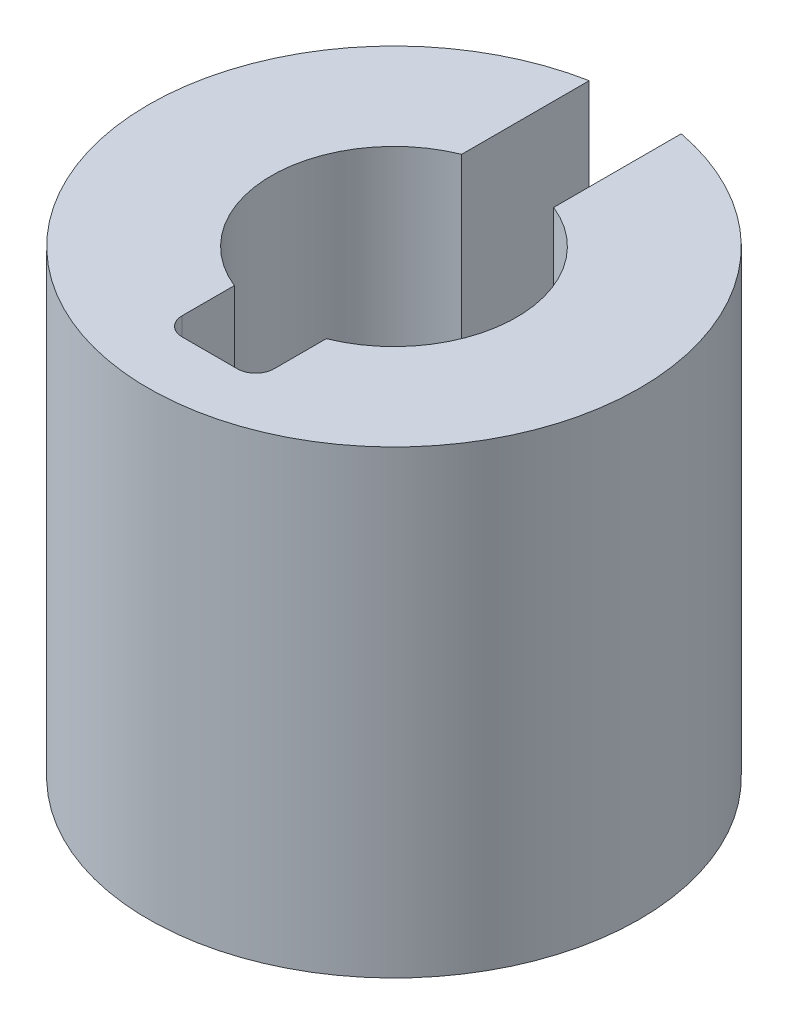
ISO-10303-21;
HEADER;
FILE_DESCRIPTION(('STEP AP214'),'2;1');
FILE_NAME('part.step','',(''),(''),'','','');
FILE_SCHEMA(('AUTOMOTIVE_DESIGN { 1 0 10303 214 1 1 1 1 }'));
ENDSEC;
DATA;
#1=APPLICATION_CONTEXT('core data for automotive mechanical design processes');
#2=APPLICATION_PROTOCOL_DEFINITION('international standard','automotive_design',2000,#1);
#3=PRODUCT_CONTEXT('',#1,'mechanical');
#4=PRODUCT('Part','Part','',(#3));
#5=PRODUCT_RELATED_PRODUCT_CATEGORY('part','',(#4));
#6=PRODUCT_DEFINITION_FORMATION('','',#4);
#7=PRODUCT_DEFINITION_CONTEXT('part definition',#1,'design');
#8=PRODUCT_DEFINITION('design','',#6,#7);
#9=PRODUCT_DEFINITION_SHAPE('','',#8);
#10=(LENGTH_UNIT() NAMED_UNIT(*) SI_UNIT(.MILLI.,.METRE.));
#11=(NAMED_UNIT(*) PLANE_ANGLE_UNIT() SI_UNIT($,.RADIAN.));
#12=(NAMED_UNIT(*) SI_UNIT($,.STERADIAN.) SOLID_ANGLE_UNIT());
#13=UNCERTAINTY_MEASURE_WITH_UNIT(LENGTH_MEASURE(1.E-05),#10,'distance_accuracy_value','');
#14=(GEOMETRIC_REPRESENTATION_CONTEXT(3) GLOBAL_UNCERTAINTY_ASSIGNED_CONTEXT((#13)) GLOBAL_UNIT_ASSIGNED_CONTEXT((#10,
#11,#12)) REPRESENTATION_CONTEXT('',''));
#15=CARTESIAN_POINT('',(0.,0.,0.));
#16=DIRECTION('',(0.,0.,1.));
#17=DIRECTION('',(1.,0.,0.));
#18=AXIS2_PLACEMENT_3D('',#15,#16,#17);
#19=CARTESIAN_POINT('',(-0.75,3.75,3.005));
#20=DIRECTION('',(0.,0.,1.));
#21=DIRECTION('',(1.,0.,0.));
#22=AXIS2_PLACEMENT_3D('',#19,#20,#21);
#23=PLANE('',#22);
#24=DIRECTION('',(0.,1.,0.));
#25=VECTOR('',#24,1.);
#26=CARTESIAN_POINT('',(-0.45,3.75,3.005));
#27=LINE('',#26,#25);
#28=CARTESIAN_POINT('',(-0.45,-3.75,3.005));
#29=VERTEX_POINT('',#28);
#30=CARTESIAN_POINT('',(-0.45,3.75,3.005));
#31=VERTEX_POINT('',#30);
#32=EDGE_CURVE('E114',#29,#31,#27,.T.);
#33=ORIENTED_EDGE('',*,*,#32,.T.);
#34=DIRECTION('',(1.,0.,0.));
#35=VECTOR('',#34,1.);
#36=CARTESIAN_POINT('',(-0.75,3.75,3.005));
#37=LINE('',#36,#35);
#38=CARTESIAN_POINT('',(0.45,3.75,3.005));
#39=VERTEX_POINT('',#38);
#40=EDGE_CURVE('E102',#39,#31,#37,.F.);
#41=ORIENTED_EDGE('',*,*,#40,.F.);
#42=DIRECTION('',(0.,1.,0.));
#43=VECTOR('',#42,1.);
#44=CARTESIAN_POINT('',(0.45,3.75,3.005));
#45=LINE('',#44,#43);
#46=CARTESIAN_POINT('',(0.45,-3.75,3.005));
#47=VERTEX_POINT('',#46);
#48=EDGE_CURVE('E101',#39,#47,#45,.F.);
#49=ORIENTED_EDGE('',*,*,#48,.T.);
#50=DIRECTION('',(1.,0.,0.));
#51=VECTOR('',#50,1.);
#52=CARTESIAN_POINT('',(-0.75,-3.75,3.005));
#53=LINE('',#52,#51);
#54=EDGE_CURVE('E91',#29,#47,#53,.T.);
#55=ORIENTED_EDGE('',*,*,#54,.F.);
#56=EDGE_LOOP('',(#33,#41,#49,#55));
#57=FACE_BOUND('',#56,.T.);
#58=ADVANCED_FACE('F16',(#57),#23,.F.);
#59=CARTESIAN_POINT('',(0.45,3.75,2.705));
#60=DIRECTION('',(0.,1.,0.));
#61=DIRECTION('',(0.,0.,1.));
#62=AXIS2_PLACEMENT_3D('',#59,#60,#61);
#63=CYLINDRICAL_SURFACE('',#62,0.3);
#64=DIRECTION('',(0.,1.,0.));
#65=VECTOR('',#64,1.);
#66=CARTESIAN_POINT('',(0.75,3.75,2.705));
#67=LINE('',#66,#65);
#68=CARTESIAN_POINT('',(0.75,3.75,2.705));
#69=VERTEX_POINT('',#68);
#70=CARTESIAN_POINT('',(0.75,-3.75,2.705));
#71=VERTEX_POINT('',#70);
#72=EDGE_CURVE('E111',#69,#71,#67,.F.);
#73=ORIENTED_EDGE('',*,*,#72,.T.);
#74=CARTESIAN_POINT('',(0.45,-3.75,2.705));
#75=DIRECTION('',(0.,1.,0.));
#76=DIRECTION('',(0.,0.,1.));
#77=AXIS2_PLACEMENT_3D('',#74,#75,#76);
#78=CIRCLE('',#77,0.3);
#79=EDGE_CURVE('E19',#47,#71,#78,.T.);
#80=ORIENTED_EDGE('',*,*,#79,.F.);
#81=ORIENTED_EDGE('',*,*,#48,.F.);
#82=CARTESIAN_POINT('',(0.45,3.75,2.705));
#83=DIRECTION('',(0.,1.,0.));
#84=DIRECTION('',(0.,0.,1.));
#85=AXIS2_PLACEMENT_3D('',#82,#83,#84);
#86=CIRCLE('',#85,0.3);
#87=EDGE_CURVE('E113',#69,#39,#86,.F.);
#88=ORIENTED_EDGE('',*,*,#87,.F.);
#89=EDGE_LOOP('',(#73,#80,#81,#88));
#90=FACE_BOUND('',#89,.T.);
#91=ADVANCED_FACE('F109',(#90),#63,.F.);
#92=CARTESIAN_POINT('',(-0.45,3.75,2.705));
#93=DIRECTION('',(0.,1.,0.));
#94=DIRECTION('',(0.,0.,1.));
#95=AXIS2_PLACEMENT_3D('',#92,#93,#94);
#96=CYLINDRICAL_SURFACE('',#95,0.3);
#97=ORIENTED_EDGE('',*,*,#32,.F.);
#98=CARTESIAN_POINT('',(-0.45,-3.75,2.705));
#99=DIRECTION('',(0.,1.,0.));
#100=DIRECTION('',(0.,0.,1.));
#101=AXIS2_PLACEMENT_3D('',#98,#99,#100);
#102=CIRCLE('',#101,0.3);
#103=CARTESIAN_POINT('',(-0.75,-3.75,2.705));
#104=VERTEX_POINT('',#103);
#105=EDGE_CURVE('E97',#104,#29,#102,.T.);
#106=ORIENTED_EDGE('',*,*,#105,.F.);
#107=DIRECTION('',(0.,1.,0.));
#108=VECTOR('',#107,1.);
#109=CARTESIAN_POINT('',(-0.75,3.75,2.705));
#110=LINE('',#109,#108);
#111=CARTESIAN_POINT('',(-0.75,3.75,2.705));
#112=VERTEX_POINT('',#111);
#113=EDGE_CURVE('E145',#104,#112,#110,.T.);
#114=ORIENTED_EDGE('',*,*,#113,.T.);
#115=CARTESIAN_POINT('',(-0.45,3.75,2.705));
#116=DIRECTION('',(0.,1.,0.));
#117=DIRECTION('',(0.,0.,1.));
#118=AXIS2_PLACEMENT_3D('',#115,#116,#117);
#119=CIRCLE('',#118,0.3);
#120=EDGE_CURVE('E117',#31,#112,#119,.F.);
#121=ORIENTED_EDGE('',*,*,#120,.F.);
#122=EDGE_LOOP('',(#97,#106,#114,#121));
#123=FACE_BOUND('',#122,.T.);
#124=ADVANCED_FACE('F183',(#123),#96,.F.);
#125=CARTESIAN_POINT('',(0.75,3.75,3.005));
#126=DIRECTION('',(1.,0.,0.));
#127=DIRECTION('',(0.,0.,-1.));
#128=AXIS2_PLACEMENT_3D('',#125,#126,#127);
#129=PLANE('',#128);
#130=ORIENTED_EDGE('',*,*,#72,.F.);
#131=DIRECTION('',(0.,0.,-1.));
#132=VECTOR('',#131,1.);
#133=CARTESIAN_POINT('',(0.75,3.75,3.005));
#134=LINE('',#133,#132);
#135=CARTESIAN_POINT('',(0.75,3.75,1.85404962177392));
#136=VERTEX_POINT('',#135);
#137=EDGE_CURVE('E119',#136,#69,#134,.F.);
#138=ORIENTED_EDGE('',*,*,#137,.F.);
#139=DIRECTION('',(0.,-1.,0.));
#140=VECTOR('',#139,1.);
#141=CARTESIAN_POINT('',(0.75,3.75,1.85404962177392));
#142=LINE('',#141,#140);
#143=CARTESIAN_POINT('',(0.75,-3.75,1.85404962177392));
#144=VERTEX_POINT('',#143);
#145=EDGE_CURVE('E153',#136,#144,#142,.T.);
#146=ORIENTED_EDGE('',*,*,#145,.T.);
#147=DIRECTION('',(0.,0.,-1.));
#148=VECTOR('',#147,1.);
#149=CARTESIAN_POINT('',(0.75,-3.75,3.005));
#150=LINE('',#149,#148);
#151=EDGE_CURVE('E144',#71,#144,#150,.T.);
#152=ORIENTED_EDGE('',*,*,#151,.F.);
#153=EDGE_LOOP('',(#130,#138,#146,#152));
#154=FACE_BOUND('',#153,.T.);
#155=ADVANCED_FACE('F180',(#154),#129,.F.);
#156=CARTESIAN_POINT('',(-0.75,3.75,3.005));
#157=DIRECTION('',(-1.,0.,0.));
#158=DIRECTION('',(0.,0.,1.));
#159=AXIS2_PLACEMENT_3D('',#156,#157,#158);
#160=PLANE('',#159);
#161=ORIENTED_EDGE('',*,*,#113,.F.);
#162=DIRECTION('',(0.,0.,1.));
#163=VECTOR('',#162,1.);
#164=CARTESIAN_POINT('',(-0.75,-3.75,3.005));
#165=LINE('',#164,#163);
#166=CARTESIAN_POINT('',(-0.75,-3.75,1.85404962177392));
#167=VERTEX_POINT('',#166);
#168=EDGE_CURVE('E149',#167,#104,#165,.T.);
#169=ORIENTED_EDGE('',*,*,#168,.F.);
#170=DIRECTION('',(0.,-1.,0.));
#171=VECTOR('',#170,1.);
#172=CARTESIAN_POINT('',(-0.749999999999999,3.75,1.85404962177392));
#173=LINE('',#172,#171);
#174=CARTESIAN_POINT('',(-0.75,3.75,1.85404962177392));
#175=VERTEX_POINT('',#174);
#176=EDGE_CURVE('E123',#167,#175,#173,.F.);
#177=ORIENTED_EDGE('',*,*,#176,.T.);
#178=DIRECTION('',(0.,0.,1.));
#179=VECTOR('',#178,1.);
#180=CARTESIAN_POINT('',(-0.75,3.75,3.005));
#181=LINE('',#180,#179);
#182=EDGE_CURVE('E148',#112,#175,#181,.F.);
#183=ORIENTED_EDGE('',*,*,#182,.F.);
#184=EDGE_LOOP('',(#161,#169,#177,#183));
#185=FACE_BOUND('',#184,.T.);
#186=ADVANCED_FACE('F182',(#185),#160,.F.);
#187=CARTESIAN_POINT('',(0.,3.75,0.));
#188=DIRECTION('',(0.,-1.,0.));
#189=DIRECTION('',(0.,0.,-1.));
#190=AXIS2_PLACEMENT_3D('',#187,#188,#189);
#191=CYLINDRICAL_SURFACE('',#190,2.);
#192=ORIENTED_EDGE('',*,*,#145,.F.);
#193=CARTESIAN_POINT('',(0.,3.75,0.));
#194=DIRECTION('',(0.,-1.,0.));
#195=DIRECTION('',(0.,0.,-1.));
#196=AXIS2_PLACEMENT_3D('',#193,#194,#195);
#197=CIRCLE('',#196,2.);
#198=CARTESIAN_POINT('',(0.75,3.75,-1.85404962177392));
#199=VERTEX_POINT('',#198);
#200=EDGE_CURVE('E127',#199,#136,#197,.T.);
#201=ORIENTED_EDGE('',*,*,#200,.F.);
#202=DIRECTION('',(0.,1.,0.));
#203=VECTOR('',#202,1.);
#204=CARTESIAN_POINT('',(0.75,3.75,-1.85404962177392));
#205=LINE('',#204,#203);
#206=CARTESIAN_POINT('',(0.75,-3.75,-1.85404962177392));
#207=VERTEX_POINT('',#206);
#208=EDGE_CURVE('E126',#199,#207,#205,.F.);
#209=ORIENTED_EDGE('',*,*,#208,.T.);
#210=CARTESIAN_POINT('',(0.,-3.75,0.));
#211=DIRECTION('',(0.,-1.,0.));
#212=DIRECTION('',(0.,0.,-1.));
#213=AXIS2_PLACEMENT_3D('',#210,#211,#212);
#214=CIRCLE('',#213,2.);
#215=EDGE_CURVE('E122',#207,#144,#214,.T.);
#216=ORIENTED_EDGE('',*,*,#215,.T.);
#217=EDGE_LOOP('',(#192,#201,#209,#216));
#218=FACE_BOUND('',#217,.T.);
#219=ADVANCED_FACE('F178',(#218),#191,.F.);
#220=CARTESIAN_POINT('',(0.,3.75,0.));
#221=DIRECTION('',(0.,-1.,0.));
#222=DIRECTION('',(0.,0.,-1.));
#223=AXIS2_PLACEMENT_3D('',#220,#221,#222);
#224=CYLINDRICAL_SURFACE('',#223,2.);
#225=DIRECTION('',(0.,1.,0.));
#226=VECTOR('',#225,1.);
#227=CARTESIAN_POINT('',(-0.75,3.75,-1.85404962177392));
#228=LINE('',#227,#226);
#229=CARTESIAN_POINT('',(-0.75,-3.75,-1.85404962177392));
#230=VERTEX_POINT('',#229);
#231=CARTESIAN_POINT('',(-0.75,3.75,-1.85404962177392));
#232=VERTEX_POINT('',#231);
#233=EDGE_CURVE('E160',#230,#232,#228,.T.);
#234=ORIENTED_EDGE('',*,*,#233,.T.);
#235=CARTESIAN_POINT('',(0.,3.75,0.));
#236=DIRECTION('',(0.,-1.,0.));
#237=DIRECTION('',(0.,0.,-1.));
#238=AXIS2_PLACEMENT_3D('',#235,#236,#237);
#239=CIRCLE('',#238,2.);
#240=EDGE_CURVE('E130',#175,#232,#239,.T.);
#241=ORIENTED_EDGE('',*,*,#240,.F.);
#242=ORIENTED_EDGE('',*,*,#176,.F.);
#243=CARTESIAN_POINT('',(0.,-3.75,0.));
#244=DIRECTION('',(0.,-1.,0.));
#245=DIRECTION('',(0.,0.,-1.));
#246=AXIS2_PLACEMENT_3D('',#243,#244,#245);
#247=CIRCLE('',#246,2.);
#248=EDGE_CURVE('E120',#167,#230,#247,.T.);
#249=ORIENTED_EDGE('',*,*,#248,.T.);
#250=EDGE_LOOP('',(#234,#241,#242,#249));
#251=FACE_BOUND('',#250,.T.);
#252=ADVANCED_FACE('F211',(#251),#224,.F.);
#253=CARTESIAN_POINT('',(0.,-3.75,0.));
#254=DIRECTION('',(0.,1.,0.));
#255=DIRECTION('',(0.,0.,1.));
#256=AXIS2_PLACEMENT_3D('',#253,#254,#255);
#257=PLANE('',#256);
#258=DIRECTION('',(0.,0.,-1.));
#259=VECTOR('',#258,1.);
#260=CARTESIAN_POINT('',(0.75,-3.75,-1.85404962177392));
#261=LINE('',#260,#259);
#262=CARTESIAN_POINT('',(0.75,-3.75,-3.9341485737069));
#263=VERTEX_POINT('',#262);
#264=EDGE_CURVE('E131',#207,#263,#261,.T.);
#265=ORIENTED_EDGE('',*,*,#264,.T.);
#266=CARTESIAN_POINT('',(0.,-3.75,0.));
#267=DIRECTION('',(0.,-1.,0.));
#268=DIRECTION('',(0.,0.,-1.));
#269=AXIS2_PLACEMENT_3D('',#266,#267,#268);
#270=CIRCLE('',#269,4.005);
#271=CARTESIAN_POINT('',(-0.75,-3.75,-3.9341485737069));
#272=VERTEX_POINT('',#271);
#273=EDGE_CURVE('E134',#272,#263,#270,.F.);
#274=ORIENTED_EDGE('',*,*,#273,.F.);
#275=DIRECTION('',(0.,0.,1.));
#276=VECTOR('',#275,1.);
#277=CARTESIAN_POINT('',(-0.75,-3.75,-1.85404962177392));
#278=LINE('',#277,#276);
#279=EDGE_CURVE('E138',#272,#230,#278,.T.);
#280=ORIENTED_EDGE('',*,*,#279,.T.);
#281=ORIENTED_EDGE('',*,*,#248,.F.);
#282=ORIENTED_EDGE('',*,*,#168,.T.);
#283=ORIENTED_EDGE('',*,*,#105,.T.);
#284=ORIENTED_EDGE('',*,*,#54,.T.);
#285=ORIENTED_EDGE('',*,*,#79,.T.);
#286=ORIENTED_EDGE('',*,*,#151,.T.);
#287=ORIENTED_EDGE('',*,*,#215,.F.);
#288=EDGE_LOOP('',(#265,#274,#280,#281,#282,#283,#284,#285,#286,#287));
#289=FACE_BOUND('',#288,.T.);
#290=ADVANCED_FACE('F93',(#289),#257,.F.);
#291=CARTESIAN_POINT('',(0.75,3.75,-1.85404962177392));
#292=DIRECTION('',(1.,0.,0.));
#293=DIRECTION('',(0.,0.,-1.));
#294=AXIS2_PLACEMENT_3D('',#291,#292,#293);
#295=PLANE('',#294);
#296=ORIENTED_EDGE('',*,*,#208,.F.);
#297=DIRECTION('',(0.,0.,1.));
#298=VECTOR('',#297,1.);
#299=CARTESIAN_POINT('',(0.75,3.75,0.));
#300=LINE('',#299,#298);
#301=CARTESIAN_POINT('',(0.75,3.75,-3.9341485737069));
#302=VERTEX_POINT('',#301);
#303=EDGE_CURVE('E133',#302,#199,#300,.T.);
#304=ORIENTED_EDGE('',*,*,#303,.F.);
#305=DIRECTION('',(0.,-1.,0.));
#306=VECTOR('',#305,1.);
#307=CARTESIAN_POINT('',(0.75,3.75,-3.9341485737069));
#308=LINE('',#307,#306);
#309=EDGE_CURVE('E137',#263,#302,#308,.F.);
#310=ORIENTED_EDGE('',*,*,#309,.F.);
#311=ORIENTED_EDGE('',*,*,#264,.F.);
#312=EDGE_LOOP('',(#296,#304,#310,#311));
#313=FACE_BOUND('',#312,.T.);
#314=ADVANCED_FACE('F173',(#313),#295,.F.);
#315=CARTESIAN_POINT('',(0.,3.75,0.));
#316=DIRECTION('',(0.,1.,0.));
#317=DIRECTION('',(0.,0.,1.));
#318=AXIS2_PLACEMENT_3D('',#315,#316,#317);
#319=PLANE('',#318);
#320=CARTESIAN_POINT('',(0.,3.75,0.));
#321=DIRECTION('',(0.,-1.,0.));
#322=DIRECTION('',(0.,0.,-1.));
#323=AXIS2_PLACEMENT_3D('',#320,#321,#322);
#324=CIRCLE('',#323,4.005);
#325=CARTESIAN_POINT('',(-0.75,3.75,-3.9341485737069));
#326=VERTEX_POINT('',#325);
#327=EDGE_CURVE('E25',#302,#326,#324,.T.);
#328=ORIENTED_EDGE('',*,*,#327,.F.);
#329=ORIENTED_EDGE('',*,*,#303,.T.);
#330=ORIENTED_EDGE('',*,*,#200,.T.);
#331=ORIENTED_EDGE('',*,*,#137,.T.);
#332=ORIENTED_EDGE('',*,*,#87,.T.);
#333=ORIENTED_EDGE('',*,*,#40,.T.);
#334=ORIENTED_EDGE('',*,*,#120,.T.);
#335=ORIENTED_EDGE('',*,*,#182,.T.);
#336=ORIENTED_EDGE('',*,*,#240,.T.);
#337=DIRECTION('',(0.,0.,1.));
#338=VECTOR('',#337,1.);
#339=CARTESIAN_POINT('',(-0.75,3.75,-1.85404962177392));
#340=LINE('',#339,#338);
#341=EDGE_CURVE('E34',#232,#326,#340,.F.);
#342=ORIENTED_EDGE('',*,*,#341,.T.);
#343=EDGE_LOOP('',(#328,#329,#330,#331,#332,#333,#334,#335,#336,#342));
#344=FACE_BOUND('',#343,.T.);
#345=ADVANCED_FACE('F169',(#344),#319,.T.);
#346=CARTESIAN_POINT('',(-0.75,3.75,-1.85404962177392));
#347=DIRECTION('',(-1.,0.,0.));
#348=DIRECTION('',(0.,0.,1.));
#349=AXIS2_PLACEMENT_3D('',#346,#347,#348);
#350=PLANE('',#349);
#351=DIRECTION('',(0.,-1.,0.));
#352=VECTOR('',#351,1.);
#353=CARTESIAN_POINT('',(-0.75,3.75,-3.9341485737069));
#354=LINE('',#353,#352);
#355=EDGE_CURVE('E11',#326,#272,#354,.T.);
#356=ORIENTED_EDGE('',*,*,#355,.F.);
#357=ORIENTED_EDGE('',*,*,#341,.F.);
#358=ORIENTED_EDGE('',*,*,#233,.F.);
#359=ORIENTED_EDGE('',*,*,#279,.F.);
#360=EDGE_LOOP('',(#356,#357,#358,#359));
#361=FACE_BOUND('',#360,.T.);
#362=ADVANCED_FACE('F196',(#361),#350,.F.);
#363=CARTESIAN_POINT('',(0.,3.75,0.));
#364=DIRECTION('',(0.,-1.,0.));
#365=DIRECTION('',(0.,0.,-1.));
#366=AXIS2_PLACEMENT_3D('',#363,#364,#365);
#367=CYLINDRICAL_SURFACE('',#366,4.005);
#368=ORIENTED_EDGE('',*,*,#327,.T.);
#369=ORIENTED_EDGE('',*,*,#355,.T.);
#370=ORIENTED_EDGE('',*,*,#273,.T.);
#371=ORIENTED_EDGE('',*,*,#309,.T.);
#372=EDGE_LOOP('',(#368,#369,#370,#371));
#373=FACE_BOUND('',#372,.T.);
#374=ADVANCED_FACE('F194',(#373),#367,.T.);
#375=CLOSED_SHELL('',(#58,#91,#124,#155,#186,#219,#252,#290,#314,#345,#362,#374));
#376=MANIFOLD_SOLID_BREP('B1',#375);
#377=ADVANCED_BREP_SHAPE_REPRESENTATION('',(#18,#376),#14);
#378=SHAPE_DEFINITION_REPRESENTATION(#9,#377);
ENDSEC;
END-ISO-10303-21;
